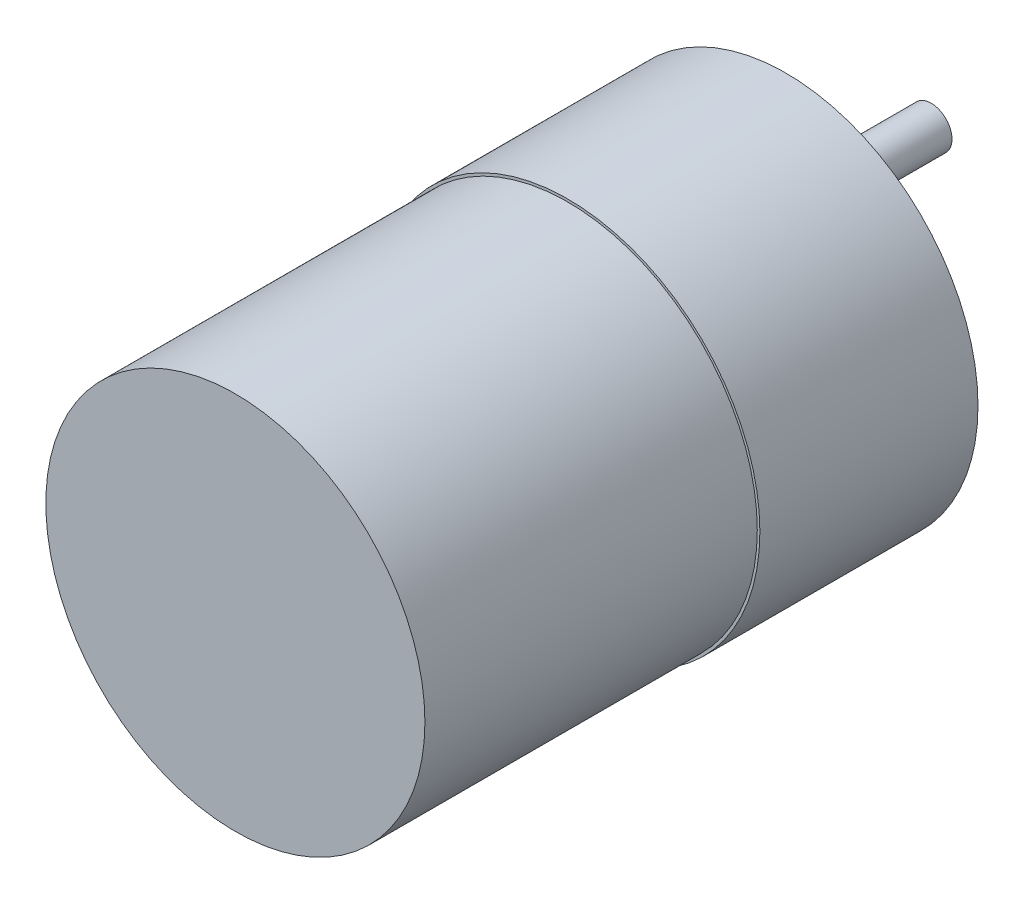
ISO-10303-21;
HEADER;
FILE_DESCRIPTION(('STEP AP214'),'2;1');
FILE_NAME('part.step','',(''),(''),'','','');
FILE_SCHEMA(('AUTOMOTIVE_DESIGN { 1 0 10303 214 1 1 1 1 }'));
ENDSEC;
DATA;
#1=APPLICATION_CONTEXT('core data for automotive mechanical design processes');
#2=APPLICATION_PROTOCOL_DEFINITION('international standard','automotive_design',2000,#1);
#3=PRODUCT_CONTEXT('',#1,'mechanical');
#4=PRODUCT('Part','Part','',(#3));
#5=PRODUCT_RELATED_PRODUCT_CATEGORY('part','',(#4));
#6=PRODUCT_DEFINITION_FORMATION('','',#4);
#7=PRODUCT_DEFINITION_CONTEXT('part definition',#1,'design');
#8=PRODUCT_DEFINITION('design','',#6,#7);
#9=PRODUCT_DEFINITION_SHAPE('','',#8);
#10=(LENGTH_UNIT() NAMED_UNIT(*) SI_UNIT(.MILLI.,.METRE.));
#11=(NAMED_UNIT(*) PLANE_ANGLE_UNIT() SI_UNIT($,.RADIAN.));
#12=(NAMED_UNIT(*) SI_UNIT($,.STERADIAN.) SOLID_ANGLE_UNIT());
#13=UNCERTAINTY_MEASURE_WITH_UNIT(LENGTH_MEASURE(1.E-05),#10,'distance_accuracy_value','');
#14=(GEOMETRIC_REPRESENTATION_CONTEXT(3) GLOBAL_UNCERTAINTY_ASSIGNED_CONTEXT((#13)) GLOBAL_UNIT_ASSIGNED_CONTEXT((#10,
#11,#12)) REPRESENTATION_CONTEXT('',''));
#15=CARTESIAN_POINT('',(0.,0.,0.));
#16=DIRECTION('',(0.,0.,1.));
#17=DIRECTION('',(1.,0.,0.));
#18=AXIS2_PLACEMENT_3D('',#15,#16,#17);
#19=CARTESIAN_POINT('',(0.,0.,-6.));
#20=DIRECTION('',(0.,0.,-1.));
#21=DIRECTION('',(-1.,0.,0.));
#22=AXIS2_PLACEMENT_3D('',#19,#20,#21);
#23=PLANE('',#22);
#24=CARTESIAN_POINT('',(0.,0.,-6.));
#25=DIRECTION('',(0.,0.,-1.));
#26=DIRECTION('',(-1.,0.,0.));
#27=AXIS2_PLACEMENT_3D('',#24,#25,#26);
#28=CIRCLE('',#27,6.);
#29=CARTESIAN_POINT('',(-6.,0.,-6.));
#30=VERTEX_POINT('',#29);
#31=EDGE_CURVE('E94',#30,#30,#28,.T.);
#32=ORIENTED_EDGE('',*,*,#31,.T.);
#33=EDGE_LOOP('',(#32));
#34=FACE_BOUND('',#33,.T.);
#35=CARTESIAN_POINT('',(0.,0.,-6.));
#36=DIRECTION('',(0.,0.,-1.));
#37=DIRECTION('',(-1.,0.,0.));
#38=AXIS2_PLACEMENT_3D('',#35,#36,#37);
#39=CIRCLE('',#38,2.);
#40=CARTESIAN_POINT('',(-2.,0.,-6.));
#41=VERTEX_POINT('',#40);
#42=EDGE_CURVE('E98',#41,#41,#39,.T.);
#43=ORIENTED_EDGE('',*,*,#42,.F.);
#44=EDGE_LOOP('',(#43));
#45=FACE_BOUND('',#44,.T.);
#46=ADVANCED_FACE('F31',(#34,#45),#23,.T.);
#47=CARTESIAN_POINT('',(7.003,0.0200000000000061,21.));
#48=DIRECTION('',(0.,0.,1.));
#49=DIRECTION('',(1.,0.,0.));
#50=AXIS2_PLACEMENT_3D('',#47,#48,#49);
#51=PLANE('',#50);
#52=CARTESIAN_POINT('',(7.003,0.0200000000000061,21.));
#53=DIRECTION('',(0.,0.,1.));
#54=DIRECTION('',(1.,0.,0.));
#55=AXIS2_PLACEMENT_3D('',#52,#53,#54);
#56=CIRCLE('',#55,18.5);
#57=CARTESIAN_POINT('',(25.503,0.0200000000000061,21.));
#58=VERTEX_POINT('',#57);
#59=EDGE_CURVE('E10',#58,#58,#56,.T.);
#60=ORIENTED_EDGE('',*,*,#59,.T.);
#61=EDGE_LOOP('',(#60));
#62=FACE_BOUND('',#61,.T.);
#63=CARTESIAN_POINT('',(7.003,0.0200000000000061,21.));
#64=DIRECTION('',(0.,0.,1.));
#65=DIRECTION('',(1.,0.,0.));
#66=AXIS2_PLACEMENT_3D('',#63,#64,#65);
#67=CIRCLE('',#66,18.25);
#68=CARTESIAN_POINT('',(25.253,0.0200000000000061,21.));
#69=VERTEX_POINT('',#68);
#70=EDGE_CURVE('E86',#69,#69,#67,.T.);
#71=ORIENTED_EDGE('',*,*,#70,.F.);
#72=EDGE_LOOP('',(#71));
#73=FACE_BOUND('',#72,.T.);
#74=ADVANCED_FACE('F114',(#62,#73),#51,.T.);
#75=CARTESIAN_POINT('',(7.003,0.0200000000000061,0.));
#76=DIRECTION('',(0.,0.,1.));
#77=DIRECTION('',(1.,0.,0.));
#78=AXIS2_PLACEMENT_3D('',#75,#76,#77);
#79=PLANE('',#78);
#80=CARTESIAN_POINT('',(7.003,-16.95,0.));
#81=DIRECTION('',(0.,0.,1.));
#82=DIRECTION('',(1.,0.,0.));
#83=AXIS2_PLACEMENT_3D('',#80,#81,#82);
#84=CIRCLE('',#83,1.25);
#85=CARTESIAN_POINT('',(8.253,-16.95,0.));
#86=VERTEX_POINT('',#85);
#87=EDGE_CURVE('E61',#86,#86,#84,.T.);
#88=ORIENTED_EDGE('',*,*,#87,.T.);
#89=EDGE_LOOP('',(#88));
#90=FACE_BOUND('',#89,.T.);
#91=CARTESIAN_POINT('',(-6.77100000000002,9.842,0.));
#92=DIRECTION('',(0.,0.,1.));
#93=DIRECTION('',(1.,0.,0.));
#94=AXIS2_PLACEMENT_3D('',#91,#92,#93);
#95=CIRCLE('',#94,1.25);
#96=CARTESIAN_POINT('',(-5.52100000000002,9.842,0.));
#97=VERTEX_POINT('',#96);
#98=EDGE_CURVE('E55',#97,#97,#95,.T.);
#99=ORIENTED_EDGE('',*,*,#98,.T.);
#100=EDGE_LOOP('',(#99));
#101=FACE_BOUND('',#100,.T.);
#102=CARTESIAN_POINT('',(20.777,9.84200000000002,0.));
#103=DIRECTION('',(0.,0.,1.));
#104=DIRECTION('',(1.,0.,0.));
#105=AXIS2_PLACEMENT_3D('',#102,#103,#104);
#106=CIRCLE('',#105,1.25);
#107=CARTESIAN_POINT('',(22.027,9.84200000000002,0.));
#108=VERTEX_POINT('',#107);
#109=EDGE_CURVE('E49',#108,#108,#106,.T.);
#110=ORIENTED_EDGE('',*,*,#109,.T.);
#111=EDGE_LOOP('',(#110));
#112=FACE_BOUND('',#111,.T.);
#113=CARTESIAN_POINT('',(20.777,-9.84199999999998,0.));
#114=DIRECTION('',(0.,0.,1.));
#115=DIRECTION('',(1.,0.,0.));
#116=AXIS2_PLACEMENT_3D('',#113,#114,#115);
#117=CIRCLE('',#116,1.25);
#118=CARTESIAN_POINT('',(22.027,-9.84199999999998,0.));
#119=VERTEX_POINT('',#118);
#120=EDGE_CURVE('E42',#119,#119,#117,.T.);
#121=ORIENTED_EDGE('',*,*,#120,.T.);
#122=EDGE_LOOP('',(#121));
#123=FACE_BOUND('',#122,.T.);
#124=CARTESIAN_POINT('',(7.003,0.0200000000000061,0.));
#125=DIRECTION('',(0.,0.,1.));
#126=DIRECTION('',(1.,0.,0.));
#127=AXIS2_PLACEMENT_3D('',#124,#125,#126);
#128=CIRCLE('',#127,18.5);
#129=CARTESIAN_POINT('',(25.503,0.0200000000000061,0.));
#130=VERTEX_POINT('',#129);
#131=EDGE_CURVE('E35',#130,#130,#128,.T.);
#132=ORIENTED_EDGE('',*,*,#131,.F.);
#133=EDGE_LOOP('',(#132));
#134=FACE_BOUND('',#133,.T.);
#135=CARTESIAN_POINT('',(23.953,0.,0.));
#136=DIRECTION('',(0.,0.,1.));
#137=DIRECTION('',(1.,0.,0.));
#138=AXIS2_PLACEMENT_3D('',#135,#136,#137);
#139=CIRCLE('',#138,1.25);
#140=CARTESIAN_POINT('',(25.203,0.,0.));
#141=VERTEX_POINT('',#140);
#142=EDGE_CURVE('E46',#141,#141,#139,.T.);
#143=ORIENTED_EDGE('',*,*,#142,.T.);
#144=EDGE_LOOP('',(#143));
#145=FACE_BOUND('',#144,.T.);
#146=CARTESIAN_POINT('',(7.00299999999999,16.95,0.));
#147=DIRECTION('',(0.,0.,1.));
#148=DIRECTION('',(1.,0.,0.));
#149=AXIS2_PLACEMENT_3D('',#146,#147,#148);
#150=CIRCLE('',#149,1.25);
#151=CARTESIAN_POINT('',(8.25299999999999,16.95,0.));
#152=VERTEX_POINT('',#151);
#153=EDGE_CURVE('E52',#152,#152,#150,.T.);
#154=ORIENTED_EDGE('',*,*,#153,.T.);
#155=EDGE_LOOP('',(#154));
#156=FACE_BOUND('',#155,.T.);
#157=CARTESIAN_POINT('',(-6.77100000000001,-9.842,0.));
#158=DIRECTION('',(0.,0.,1.));
#159=DIRECTION('',(1.,0.,0.));
#160=AXIS2_PLACEMENT_3D('',#157,#158,#159);
#161=CIRCLE('',#160,1.25);
#162=CARTESIAN_POINT('',(-5.52100000000001,-9.842,0.));
#163=VERTEX_POINT('',#162);
#164=EDGE_CURVE('E58',#163,#163,#161,.T.);
#165=ORIENTED_EDGE('',*,*,#164,.T.);
#166=EDGE_LOOP('',(#165));
#167=FACE_BOUND('',#166,.T.);
#168=CARTESIAN_POINT('',(0.,0.,0.));
#169=DIRECTION('',(0.,0.,1.));
#170=DIRECTION('',(1.,0.,0.));
#171=AXIS2_PLACEMENT_3D('',#168,#169,#170);
#172=CIRCLE('',#171,6.);
#173=CARTESIAN_POINT('',(6.,0.,0.));
#174=VERTEX_POINT('',#173);
#175=EDGE_CURVE('E89',#174,#174,#172,.F.);
#176=ORIENTED_EDGE('',*,*,#175,.F.);
#177=EDGE_LOOP('',(#176));
#178=FACE_BOUND('',#177,.T.);
#179=ADVANCED_FACE('F120',(#90,#101,#112,#123,#134,#145,#156,#167,#178),#79,.F.);
#180=CARTESIAN_POINT('',(7.003,0.0200000000000061,21.));
#181=DIRECTION('',(0.,0.,-1.));
#182=DIRECTION('',(-1.,0.,0.));
#183=AXIS2_PLACEMENT_3D('',#180,#181,#182);
#184=CYLINDRICAL_SURFACE('',#183,18.5);
#185=ORIENTED_EDGE('',*,*,#59,.F.);
#186=EDGE_LOOP('',(#185));
#187=FACE_BOUND('',#186,.T.);
#188=ORIENTED_EDGE('',*,*,#131,.T.);
#189=EDGE_LOOP('',(#188));
#190=FACE_BOUND('',#189,.T.);
#191=ADVANCED_FACE('F33',(#187,#190),#184,.T.);
#192=CARTESIAN_POINT('',(20.777,-9.84199999999998,21.));
#193=DIRECTION('',(0.,0.,-1.));
#194=DIRECTION('',(-1.,0.,0.));
#195=AXIS2_PLACEMENT_3D('',#192,#193,#194);
#196=CYLINDRICAL_SURFACE('',#195,1.25);
#197=CARTESIAN_POINT('',(20.777,-9.84199999999998,21.));
#198=DIRECTION('',(0.,0.,1.));
#199=DIRECTION('',(1.,0.,0.));
#200=AXIS2_PLACEMENT_3D('',#197,#198,#199);
#201=CIRCLE('',#200,1.25);
#202=CARTESIAN_POINT('',(22.027,-9.84199999999998,21.));
#203=VERTEX_POINT('',#202);
#204=EDGE_CURVE('E64',#203,#203,#201,.T.);
#205=ORIENTED_EDGE('',*,*,#204,.T.);
#206=EDGE_LOOP('',(#205));
#207=FACE_BOUND('',#206,.T.);
#208=ORIENTED_EDGE('',*,*,#120,.F.);
#209=EDGE_LOOP('',(#208));
#210=FACE_BOUND('',#209,.T.);
#211=ADVANCED_FACE('F164',(#207,#210),#196,.F.);
#212=CARTESIAN_POINT('',(23.953,0.,21.));
#213=DIRECTION('',(0.,0.,-1.));
#214=DIRECTION('',(-1.,0.,0.));
#215=AXIS2_PLACEMENT_3D('',#212,#213,#214);
#216=CYLINDRICAL_SURFACE('',#215,1.25);
#217=CARTESIAN_POINT('',(23.953,0.,21.));
#218=DIRECTION('',(0.,0.,1.));
#219=DIRECTION('',(1.,0.,0.));
#220=AXIS2_PLACEMENT_3D('',#217,#218,#219);
#221=CIRCLE('',#220,1.25);
#222=CARTESIAN_POINT('',(25.203,0.,21.));
#223=VERTEX_POINT('',#222);
#224=EDGE_CURVE('E67',#223,#223,#221,.T.);
#225=ORIENTED_EDGE('',*,*,#224,.T.);
#226=EDGE_LOOP('',(#225));
#227=FACE_BOUND('',#226,.T.);
#228=ORIENTED_EDGE('',*,*,#142,.F.);
#229=EDGE_LOOP('',(#228));
#230=FACE_BOUND('',#229,.T.);
#231=ADVANCED_FACE('F160',(#227,#230),#216,.F.);
#232=CARTESIAN_POINT('',(20.777,9.84200000000002,21.));
#233=DIRECTION('',(0.,0.,-1.));
#234=DIRECTION('',(-1.,0.,0.));
#235=AXIS2_PLACEMENT_3D('',#232,#233,#234);
#236=CYLINDRICAL_SURFACE('',#235,1.25);
#237=CARTESIAN_POINT('',(20.777,9.84200000000002,21.));
#238=DIRECTION('',(0.,0.,1.));
#239=DIRECTION('',(1.,0.,0.));
#240=AXIS2_PLACEMENT_3D('',#237,#238,#239);
#241=CIRCLE('',#240,1.25);
#242=CARTESIAN_POINT('',(22.027,9.84200000000002,21.));
#243=VERTEX_POINT('',#242);
#244=EDGE_CURVE('E70',#243,#243,#241,.T.);
#245=ORIENTED_EDGE('',*,*,#244,.T.);
#246=EDGE_LOOP('',(#245));
#247=FACE_BOUND('',#246,.T.);
#248=ORIENTED_EDGE('',*,*,#109,.F.);
#249=EDGE_LOOP('',(#248));
#250=FACE_BOUND('',#249,.T.);
#251=ADVANCED_FACE('F156',(#247,#250),#236,.F.);
#252=CARTESIAN_POINT('',(7.00299999999999,16.95,21.));
#253=DIRECTION('',(0.,0.,-1.));
#254=DIRECTION('',(-1.,0.,0.));
#255=AXIS2_PLACEMENT_3D('',#252,#253,#254);
#256=CYLINDRICAL_SURFACE('',#255,1.25);
#257=CARTESIAN_POINT('',(7.00299999999999,16.95,21.));
#258=DIRECTION('',(0.,0.,1.));
#259=DIRECTION('',(1.,0.,0.));
#260=AXIS2_PLACEMENT_3D('',#257,#258,#259);
#261=CIRCLE('',#260,1.25);
#262=CARTESIAN_POINT('',(8.25299999999999,16.95,21.));
#263=VERTEX_POINT('',#262);
#264=EDGE_CURVE('E73',#263,#263,#261,.T.);
#265=ORIENTED_EDGE('',*,*,#264,.T.);
#266=EDGE_LOOP('',(#265));
#267=FACE_BOUND('',#266,.T.);
#268=ORIENTED_EDGE('',*,*,#153,.F.);
#269=EDGE_LOOP('',(#268));
#270=FACE_BOUND('',#269,.T.);
#271=ADVANCED_FACE('F152',(#267,#270),#256,.F.);
#272=CARTESIAN_POINT('',(-6.77100000000002,9.842,21.));
#273=DIRECTION('',(0.,0.,-1.));
#274=DIRECTION('',(-1.,0.,0.));
#275=AXIS2_PLACEMENT_3D('',#272,#273,#274);
#276=CYLINDRICAL_SURFACE('',#275,1.25);
#277=CARTESIAN_POINT('',(-6.77100000000002,9.842,21.));
#278=DIRECTION('',(0.,0.,1.));
#279=DIRECTION('',(1.,0.,0.));
#280=AXIS2_PLACEMENT_3D('',#277,#278,#279);
#281=CIRCLE('',#280,1.25);
#282=CARTESIAN_POINT('',(-5.52100000000002,9.842,21.));
#283=VERTEX_POINT('',#282);
#284=EDGE_CURVE('E76',#283,#283,#281,.T.);
#285=ORIENTED_EDGE('',*,*,#284,.T.);
#286=EDGE_LOOP('',(#285));
#287=FACE_BOUND('',#286,.T.);
#288=ORIENTED_EDGE('',*,*,#98,.F.);
#289=EDGE_LOOP('',(#288));
#290=FACE_BOUND('',#289,.T.);
#291=ADVANCED_FACE('F148',(#287,#290),#276,.F.);
#292=CARTESIAN_POINT('',(-6.77100000000001,-9.842,21.));
#293=DIRECTION('',(0.,0.,-1.));
#294=DIRECTION('',(-1.,0.,0.));
#295=AXIS2_PLACEMENT_3D('',#292,#293,#294);
#296=CYLINDRICAL_SURFACE('',#295,1.25);
#297=CARTESIAN_POINT('',(-6.77100000000001,-9.842,21.));
#298=DIRECTION('',(0.,0.,1.));
#299=DIRECTION('',(1.,0.,0.));
#300=AXIS2_PLACEMENT_3D('',#297,#298,#299);
#301=CIRCLE('',#300,1.25);
#302=CARTESIAN_POINT('',(-5.52100000000001,-9.842,21.));
#303=VERTEX_POINT('',#302);
#304=EDGE_CURVE('E79',#303,#303,#301,.T.);
#305=ORIENTED_EDGE('',*,*,#304,.T.);
#306=EDGE_LOOP('',(#305));
#307=FACE_BOUND('',#306,.T.);
#308=ORIENTED_EDGE('',*,*,#164,.F.);
#309=EDGE_LOOP('',(#308));
#310=FACE_BOUND('',#309,.T.);
#311=ADVANCED_FACE('F144',(#307,#310),#296,.F.);
#312=CARTESIAN_POINT('',(7.003,-16.95,21.));
#313=DIRECTION('',(0.,0.,-1.));
#314=DIRECTION('',(-1.,0.,0.));
#315=AXIS2_PLACEMENT_3D('',#312,#313,#314);
#316=CYLINDRICAL_SURFACE('',#315,1.25);
#317=CARTESIAN_POINT('',(7.003,-16.95,21.));
#318=DIRECTION('',(0.,0.,1.));
#319=DIRECTION('',(1.,0.,0.));
#320=AXIS2_PLACEMENT_3D('',#317,#318,#319);
#321=CIRCLE('',#320,1.25);
#322=CARTESIAN_POINT('',(8.253,-16.95,21.));
#323=VERTEX_POINT('',#322);
#324=EDGE_CURVE('E82',#323,#323,#321,.T.);
#325=ORIENTED_EDGE('',*,*,#324,.T.);
#326=EDGE_LOOP('',(#325));
#327=FACE_BOUND('',#326,.T.);
#328=ORIENTED_EDGE('',*,*,#87,.F.);
#329=EDGE_LOOP('',(#328));
#330=FACE_BOUND('',#329,.T.);
#331=ADVANCED_FACE('F141',(#327,#330),#316,.F.);
#332=CARTESIAN_POINT('',(7.003,0.0200000000000061,21.));
#333=DIRECTION('',(0.,0.,1.));
#334=DIRECTION('',(1.,0.,0.));
#335=AXIS2_PLACEMENT_3D('',#332,#333,#334);
#336=PLANE('',#335);
#337=ORIENTED_EDGE('',*,*,#324,.F.);
#338=EDGE_LOOP('',(#337));
#339=FACE_BOUND('',#338,.T.);
#340=ADVANCED_FACE('F137',(#339),#336,.F.);
#341=ORIENTED_EDGE('',*,*,#304,.F.);
#342=EDGE_LOOP('',(#341));
#343=FACE_BOUND('',#342,.T.);
#344=ADVANCED_FACE('F237',(#343),#336,.F.);
#345=ORIENTED_EDGE('',*,*,#284,.F.);
#346=EDGE_LOOP('',(#345));
#347=FACE_BOUND('',#346,.T.);
#348=ADVANCED_FACE('F244',(#347),#336,.F.);
#349=ORIENTED_EDGE('',*,*,#264,.F.);
#350=EDGE_LOOP('',(#349));
#351=FACE_BOUND('',#350,.T.);
#352=ADVANCED_FACE('F251',(#351),#336,.F.);
#353=ORIENTED_EDGE('',*,*,#244,.F.);
#354=EDGE_LOOP('',(#353));
#355=FACE_BOUND('',#354,.T.);
#356=ADVANCED_FACE('F258',(#355),#336,.F.);
#357=ORIENTED_EDGE('',*,*,#224,.F.);
#358=EDGE_LOOP('',(#357));
#359=FACE_BOUND('',#358,.T.);
#360=ADVANCED_FACE('F135',(#359),#336,.F.);
#361=ORIENTED_EDGE('',*,*,#204,.F.);
#362=EDGE_LOOP('',(#361));
#363=FACE_BOUND('',#362,.T.);
#364=ADVANCED_FACE('F132',(#363),#336,.F.);
#365=CARTESIAN_POINT('',(7.003,0.0200000000000061,53.));
#366=DIRECTION('',(0.,0.,-1.));
#367=DIRECTION('',(-1.,0.,0.));
#368=AXIS2_PLACEMENT_3D('',#365,#366,#367);
#369=CYLINDRICAL_SURFACE('',#368,18.25);
#370=CARTESIAN_POINT('',(7.003,0.0200000000000061,53.));
#371=DIRECTION('',(0.,0.,1.));
#372=DIRECTION('',(1.,0.,0.));
#373=AXIS2_PLACEMENT_3D('',#370,#371,#372);
#374=CIRCLE('',#373,18.25);
#375=CARTESIAN_POINT('',(25.253,0.0200000000000061,53.));
#376=VERTEX_POINT('',#375);
#377=EDGE_CURVE('E85',#376,#376,#374,.T.);
#378=ORIENTED_EDGE('',*,*,#377,.F.);
#379=EDGE_LOOP('',(#378));
#380=FACE_BOUND('',#379,.T.);
#381=ORIENTED_EDGE('',*,*,#70,.T.);
#382=EDGE_LOOP('',(#381));
#383=FACE_BOUND('',#382,.T.);
#384=ADVANCED_FACE('F130',(#380,#383),#369,.T.);
#385=CARTESIAN_POINT('',(7.003,0.0200000000000061,53.));
#386=DIRECTION('',(0.,0.,1.));
#387=DIRECTION('',(1.,0.,0.));
#388=AXIS2_PLACEMENT_3D('',#385,#386,#387);
#389=PLANE('',#388);
#390=ORIENTED_EDGE('',*,*,#377,.T.);
#391=EDGE_LOOP('',(#390));
#392=FACE_BOUND('',#391,.T.);
#393=ADVANCED_FACE('F126',(#392),#389,.T.);
#394=CARTESIAN_POINT('',(0.,0.,-6.));
#395=DIRECTION('',(0.,0.,1.));
#396=DIRECTION('',(1.,0.,0.));
#397=AXIS2_PLACEMENT_3D('',#394,#395,#396);
#398=CYLINDRICAL_SURFACE('',#397,6.);
#399=ORIENTED_EDGE('',*,*,#31,.F.);
#400=EDGE_LOOP('',(#399));
#401=FACE_BOUND('',#400,.T.);
#402=ORIENTED_EDGE('',*,*,#175,.T.);
#403=EDGE_LOOP('',(#402));
#404=FACE_BOUND('',#403,.T.);
#405=ADVANCED_FACE('F109',(#401,#404),#398,.T.);
#406=CARTESIAN_POINT('',(0.,0.,-21.));
#407=DIRECTION('',(0.,0.,1.));
#408=DIRECTION('',(1.,0.,0.));
#409=AXIS2_PLACEMENT_3D('',#406,#407,#408);
#410=CYLINDRICAL_SURFACE('',#409,2.);
#411=CARTESIAN_POINT('',(0.,0.,-21.));
#412=DIRECTION('',(0.,0.,-1.));
#413=DIRECTION('',(-1.,0.,0.));
#414=AXIS2_PLACEMENT_3D('',#411,#412,#413);
#415=CIRCLE('',#414,2.);
#416=CARTESIAN_POINT('',(-2.,0.,-21.));
#417=VERTEX_POINT('',#416);
#418=EDGE_CURVE('E97',#417,#417,#415,.T.);
#419=ORIENTED_EDGE('',*,*,#418,.F.);
#420=EDGE_LOOP('',(#419));
#421=FACE_BOUND('',#420,.T.);
#422=ORIENTED_EDGE('',*,*,#42,.T.);
#423=EDGE_LOOP('',(#422));
#424=FACE_BOUND('',#423,.T.);
#425=ADVANCED_FACE('F106',(#421,#424),#410,.T.);
#426=CARTESIAN_POINT('',(0.,0.,-21.));
#427=DIRECTION('',(0.,0.,-1.));
#428=DIRECTION('',(-1.,0.,0.));
#429=AXIS2_PLACEMENT_3D('',#426,#427,#428);
#430=PLANE('',#429);
#431=ORIENTED_EDGE('',*,*,#418,.T.);
#432=EDGE_LOOP('',(#431));
#433=FACE_BOUND('',#432,.T.);
#434=ADVANCED_FACE('F104',(#433),#430,.T.);
#435=CLOSED_SHELL('',(#46,#74,#179,#191,#211,#231,#251,#271,#291,#311,#331,#340,#344,#348,#352,
#356,#360,#364,#384,#393,#405,#425,#434));
#436=MANIFOLD_SOLID_BREP('B2',#435);
#437=ADVANCED_BREP_SHAPE_REPRESENTATION('',(#18,#436),#14);
#438=SHAPE_DEFINITION_REPRESENTATION(#9,#437);
ENDSEC;
END-ISO-10303-21;
